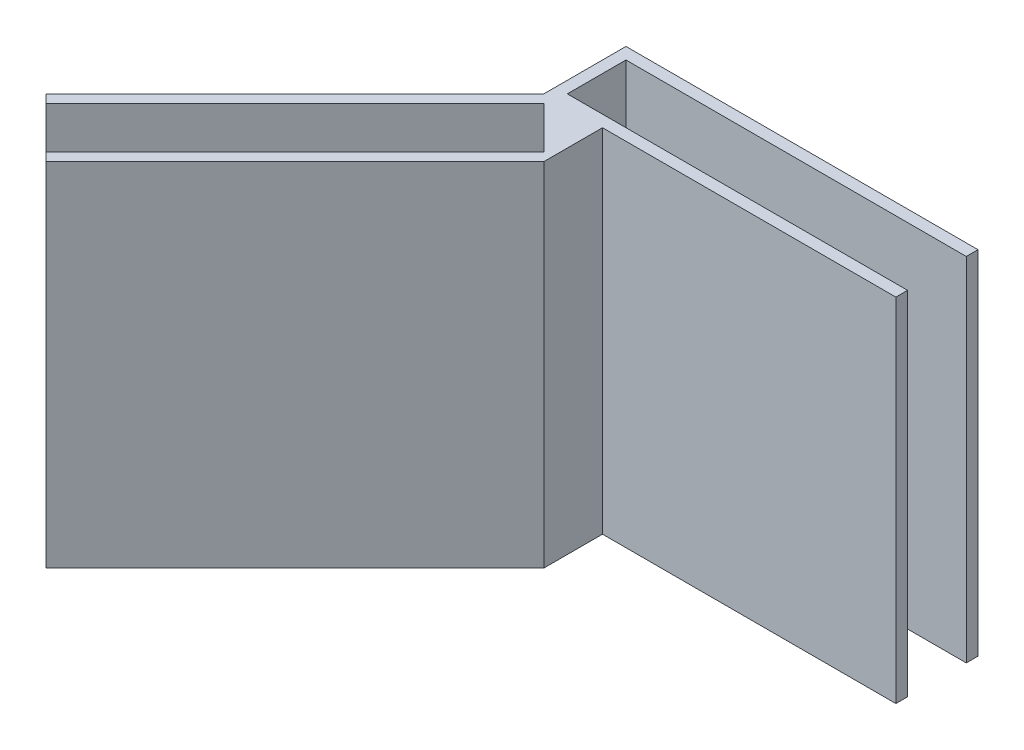
ISO-10303-21;
HEADER;
FILE_DESCRIPTION(('STEP AP214'),'2;1');
FILE_NAME('part.step','',(''),(''),'','','');
FILE_SCHEMA(('AUTOMOTIVE_DESIGN { 1 0 10303 214 1 1 1 1 }'));
ENDSEC;
DATA;
#1=APPLICATION_CONTEXT('core data for automotive mechanical design processes');
#2=APPLICATION_PROTOCOL_DEFINITION('international standard','automotive_design',2000,#1);
#3=PRODUCT_CONTEXT('',#1,'mechanical');
#4=PRODUCT('Part','Part','',(#3));
#5=PRODUCT_RELATED_PRODUCT_CATEGORY('part','',(#4));
#6=PRODUCT_DEFINITION_FORMATION('','',#4);
#7=PRODUCT_DEFINITION_CONTEXT('part definition',#1,'design');
#8=PRODUCT_DEFINITION('design','',#6,#7);
#9=PRODUCT_DEFINITION_SHAPE('','',#8);
#10=(LENGTH_UNIT() NAMED_UNIT(*) SI_UNIT(.MILLI.,.METRE.));
#11=(NAMED_UNIT(*) PLANE_ANGLE_UNIT() SI_UNIT($,.RADIAN.));
#12=(NAMED_UNIT(*) SI_UNIT($,.STERADIAN.) SOLID_ANGLE_UNIT());
#13=UNCERTAINTY_MEASURE_WITH_UNIT(LENGTH_MEASURE(1.E-05),#10,'distance_accuracy_value','');
#14=(GEOMETRIC_REPRESENTATION_CONTEXT(3) GLOBAL_UNCERTAINTY_ASSIGNED_CONTEXT((#13)) GLOBAL_UNIT_ASSIGNED_CONTEXT((#10,
#11,#12)) REPRESENTATION_CONTEXT('',''));
#15=CARTESIAN_POINT('',(0.,0.,0.));
#16=DIRECTION('',(0.,0.,1.));
#17=DIRECTION('',(1.,0.,0.));
#18=AXIS2_PLACEMENT_3D('',#15,#16,#17);
#19=CARTESIAN_POINT('',(-24.7132034355964,0.,24.7132034355964));
#20=DIRECTION('',(-0.707106781186548,0.,0.707106781186547));
#21=DIRECTION('',(0.707106781186547,0.,0.707106781186548));
#22=AXIS2_PLACEMENT_3D('',#19,#20,#21);
#23=PLANE('',#22);
#24=DIRECTION('',(0.,-1.,0.));
#25=VECTOR('',#24,1.);
#26=CARTESIAN_POINT('',(-20.5060966544099,22.,28.920310216783));
#27=LINE('',#26,#25);
#28=CARTESIAN_POINT('',(-20.5060966544099,30.,28.920310216783));
#29=VERTEX_POINT('',#28);
#30=CARTESIAN_POINT('',(-20.5060966544099,0.,28.920310216783));
#31=VERTEX_POINT('',#30);
#32=EDGE_CURVE('E255',#29,#31,#27,.T.);
#33=ORIENTED_EDGE('',*,*,#32,.F.);
#34=DIRECTION('',(0.707106781186547,0.,0.707106781186548));
#35=VECTOR('',#34,1.);
#36=CARTESIAN_POINT('',(-21.2132034355964,30.,28.2132034355964));
#37=LINE('',#36,#35);
#38=CARTESIAN_POINT('',(-21.2132034355964,30.,28.2132034355964));
#39=VERTEX_POINT('',#38);
#40=EDGE_CURVE('E243',#39,#29,#37,.T.);
#41=ORIENTED_EDGE('',*,*,#40,.F.);
#42=DIRECTION('',(0.,-1.,0.));
#43=VECTOR('',#42,1.);
#44=CARTESIAN_POINT('',(-21.2132034355964,23.,28.2132034355964));
#45=LINE('',#44,#43);
#46=CARTESIAN_POINT('',(-21.2132034355964,0.,28.2132034355964));
#47=VERTEX_POINT('',#46);
#48=EDGE_CURVE('E259',#39,#47,#45,.T.);
#49=ORIENTED_EDGE('',*,*,#48,.T.);
#50=DIRECTION('',(0.707106781186547,0.,0.707106781186548));
#51=VECTOR('',#50,1.);
#52=CARTESIAN_POINT('',(-21.2132034355964,0.,28.2132034355964));
#53=LINE('',#52,#51);
#54=EDGE_CURVE('E268',#47,#31,#53,.T.);
#55=ORIENTED_EDGE('',*,*,#54,.T.);
#56=EDGE_LOOP('',(#33,#41,#49,#55));
#57=FACE_BOUND('',#56,.T.);
#58=ADVANCED_FACE('F35',(#57),#23,.T.);
#59=CARTESIAN_POINT('',(30.,0.,7.));
#60=DIRECTION('',(-1.,0.,0.));
#61=DIRECTION('',(0.,0.,1.));
#62=AXIS2_PLACEMENT_3D('',#59,#60,#61);
#63=PLANE('',#62);
#64=DIRECTION('',(0.,1.,0.));
#65=VECTOR('',#64,1.);
#66=CARTESIAN_POINT('',(30.,0.,6.));
#67=LINE('',#66,#65);
#68=CARTESIAN_POINT('',(30.,0.,6.));
#69=VERTEX_POINT('',#68);
#70=CARTESIAN_POINT('',(30.,30.,6.));
#71=VERTEX_POINT('',#70);
#72=EDGE_CURVE('E118',#69,#71,#67,.T.);
#73=ORIENTED_EDGE('',*,*,#72,.T.);
#74=DIRECTION('',(0.,0.,-1.));
#75=VECTOR('',#74,1.);
#76=CARTESIAN_POINT('',(30.,30.,7.));
#77=LINE('',#76,#75);
#78=CARTESIAN_POINT('',(30.,30.,7.));
#79=VERTEX_POINT('',#78);
#80=EDGE_CURVE('E88',#79,#71,#77,.T.);
#81=ORIENTED_EDGE('',*,*,#80,.F.);
#82=DIRECTION('',(0.,1.,0.));
#83=VECTOR('',#82,1.);
#84=CARTESIAN_POINT('',(30.,0.,7.));
#85=LINE('',#84,#83);
#86=CARTESIAN_POINT('',(30.,0.,7.));
#87=VERTEX_POINT('',#86);
#88=EDGE_CURVE('E105',#87,#79,#85,.T.);
#89=ORIENTED_EDGE('',*,*,#88,.F.);
#90=DIRECTION('',(0.,0.,-1.));
#91=VECTOR('',#90,1.);
#92=CARTESIAN_POINT('',(30.,0.,7.));
#93=LINE('',#92,#91);
#94=EDGE_CURVE('E43',#87,#69,#93,.T.);
#95=ORIENTED_EDGE('',*,*,#94,.T.);
#96=EDGE_LOOP('',(#73,#81,#89,#95));
#97=FACE_BOUND('',#96,.T.);
#98=ADVANCED_FACE('F114',(#97),#63,.F.);
#99=CARTESIAN_POINT('',(0.,0.,7.));
#100=DIRECTION('',(0.,0.,-1.));
#101=DIRECTION('',(-1.,0.,0.));
#102=AXIS2_PLACEMENT_3D('',#99,#100,#101);
#103=PLANE('',#102);
#104=DIRECTION('',(-1.,0.,0.));
#105=VECTOR('',#104,1.);
#106=CARTESIAN_POINT('',(0.,30.,7.));
#107=LINE('',#106,#105);
#108=CARTESIAN_POINT('',(5.,30.,7.));
#109=VERTEX_POINT('',#108);
#110=EDGE_CURVE('E245',#79,#109,#107,.T.);
#111=ORIENTED_EDGE('',*,*,#110,.T.);
#112=DIRECTION('',(0.,1.,0.));
#113=VECTOR('',#112,1.);
#114=CARTESIAN_POINT('',(5.,0.,7.));
#115=LINE('',#114,#113);
#116=CARTESIAN_POINT('',(5.,0.,7.));
#117=VERTEX_POINT('',#116);
#118=EDGE_CURVE('E50',#117,#109,#115,.T.);
#119=ORIENTED_EDGE('',*,*,#118,.F.);
#120=DIRECTION('',(1.,0.,0.));
#121=VECTOR('',#120,1.);
#122=CARTESIAN_POINT('',(0.,0.,7.));
#123=LINE('',#122,#121);
#124=EDGE_CURVE('E55',#117,#87,#123,.T.);
#125=ORIENTED_EDGE('',*,*,#124,.T.);
#126=ORIENTED_EDGE('',*,*,#88,.T.);
#127=EDGE_LOOP('',(#111,#119,#125,#126));
#128=FACE_BOUND('',#127,.T.);
#129=ADVANCED_FACE('F332',(#128),#103,.F.);
#130=CARTESIAN_POINT('',(-21.2132034355964,23.,28.2132034355964));
#131=DIRECTION('',(0.707106781186547,0.,0.707106781186548));
#132=DIRECTION('',(0.707106781186548,0.,-0.707106781186547));
#133=AXIS2_PLACEMENT_3D('',#130,#131,#132);
#134=PLANE('',#133);
#135=ORIENTED_EDGE('',*,*,#48,.F.);
#136=DIRECTION('',(-0.707106781186547,0.,0.707106781186547));
#137=VECTOR('',#136,1.);
#138=CARTESIAN_POINT('',(0.,30.,7.));
#139=LINE('',#138,#137);
#140=CARTESIAN_POINT('',(0.,30.,7.));
#141=VERTEX_POINT('',#140);
#142=EDGE_CURVE('E155',#141,#39,#139,.T.);
#143=ORIENTED_EDGE('',*,*,#142,.F.);
#144=DIRECTION('',(0.,-1.,0.));
#145=VECTOR('',#144,1.);
#146=CARTESIAN_POINT('',(0.,23.,7.));
#147=LINE('',#146,#145);
#148=CARTESIAN_POINT('',(0.,0.,7.));
#149=VERTEX_POINT('',#148);
#150=EDGE_CURVE('E151',#141,#149,#147,.T.);
#151=ORIENTED_EDGE('',*,*,#150,.T.);
#152=DIRECTION('',(0.707106781186548,0.,-0.707106781186547));
#153=VECTOR('',#152,1.);
#154=CARTESIAN_POINT('',(-21.2132034355964,0.,28.2132034355964));
#155=LINE('',#154,#153);
#156=EDGE_CURVE('E274',#47,#149,#155,.T.);
#157=ORIENTED_EDGE('',*,*,#156,.F.);
#158=EDGE_LOOP('',(#135,#143,#151,#157));
#159=FACE_BOUND('',#158,.T.);
#160=ADVANCED_FACE('F335',(#159),#134,.F.);
#161=CARTESIAN_POINT('',(0.,0.,7.));
#162=DIRECTION('',(1.,0.,0.));
#163=DIRECTION('',(0.,0.,-1.));
#164=AXIS2_PLACEMENT_3D('',#161,#162,#163);
#165=PLANE('',#164);
#166=DIRECTION('',(0.,0.,-1.));
#167=VECTOR('',#166,1.);
#168=CARTESIAN_POINT('',(0.,0.,7.));
#169=LINE('',#168,#167);
#170=CARTESIAN_POINT('',(0.,0.,0.));
#171=VERTEX_POINT('',#170);
#172=EDGE_CURVE('E11',#149,#171,#169,.T.);
#173=ORIENTED_EDGE('',*,*,#172,.F.);
#174=ORIENTED_EDGE('',*,*,#150,.F.);
#175=DIRECTION('',(0.,0.,-1.));
#176=VECTOR('',#175,1.);
#177=CARTESIAN_POINT('',(0.,30.,7.));
#178=LINE('',#177,#176);
#179=CARTESIAN_POINT('',(0.,30.,0.));
#180=VERTEX_POINT('',#179);
#181=EDGE_CURVE('E89',#141,#180,#178,.T.);
#182=ORIENTED_EDGE('',*,*,#181,.T.);
#183=DIRECTION('',(0.,-1.,0.));
#184=VECTOR('',#183,1.);
#185=CARTESIAN_POINT('',(0.,0.,0.));
#186=LINE('',#185,#184);
#187=EDGE_CURVE('E103',#180,#171,#186,.T.);
#188=ORIENTED_EDGE('',*,*,#187,.T.);
#189=EDGE_LOOP('',(#173,#174,#182,#188));
#190=FACE_BOUND('',#189,.T.);
#191=ADVANCED_FACE('F37',(#190),#165,.F.);
#192=CARTESIAN_POINT('',(0.,0.,7.));
#193=DIRECTION('',(0.,1.,0.));
#194=DIRECTION('',(0.,0.,1.));
#195=AXIS2_PLACEMENT_3D('',#192,#193,#194);
#196=PLANE('',#195);
#197=CARTESIAN_POINT('',(-16.920310216783,0.,32.5060966544099));
#198=VERTEX_POINT('',#197);
#199=CARTESIAN_POINT('',(-16.2132034355964,0.,33.2132034355964));
#200=VERTEX_POINT('',#199);
#201=EDGE_CURVE('E267',#198,#200,#53,.T.);
#202=ORIENTED_EDGE('',*,*,#201,.F.);
#203=DIRECTION('',(-0.707106781186546,0.,0.707106781186549));
#204=VECTOR('',#203,1.);
#205=CARTESIAN_POINT('',(-16.2132034355964,0.,31.7989898732233));
#206=LINE('',#205,#204);
#207=CARTESIAN_POINT('',(4.29289321881345,0.,11.2928932188134));
#208=VERTEX_POINT('',#207);
#209=EDGE_CURVE('E253',#208,#198,#206,.T.);
#210=ORIENTED_EDGE('',*,*,#209,.F.);
#211=DIRECTION('',(0.707106781186547,0.,0.707106781186547));
#212=VECTOR('',#211,1.);
#213=CARTESIAN_POINT('',(4.29289321881345,0.,11.2928932188134));
#214=LINE('',#213,#212);
#215=CARTESIAN_POINT('',(0.707106781186545,0.,7.70710678118655));
#216=VERTEX_POINT('',#215);
#217=EDGE_CURVE('E250',#216,#208,#214,.T.);
#218=ORIENTED_EDGE('',*,*,#217,.F.);
#219=DIRECTION('',(0.707106781186548,0.,-0.707106781186548));
#220=VECTOR('',#219,1.);
#221=CARTESIAN_POINT('',(-19.7989898732233,0.,28.2132034355964));
#222=LINE('',#221,#220);
#223=EDGE_CURVE('E247',#31,#216,#222,.T.);
#224=ORIENTED_EDGE('',*,*,#223,.F.);
#225=ORIENTED_EDGE('',*,*,#54,.F.);
#226=ORIENTED_EDGE('',*,*,#156,.T.);
#227=ORIENTED_EDGE('',*,*,#172,.T.);
#228=DIRECTION('',(1.,0.,0.));
#229=VECTOR('',#228,1.);
#230=CARTESIAN_POINT('',(0.,0.,0.));
#231=LINE('',#230,#229);
#232=CARTESIAN_POINT('',(30.,0.,0.));
#233=VERTEX_POINT('',#232);
#234=EDGE_CURVE('E99',#171,#233,#231,.T.);
#235=ORIENTED_EDGE('',*,*,#234,.T.);
#236=CARTESIAN_POINT('',(30.,0.,1.));
#237=VERTEX_POINT('',#236);
#238=EDGE_CURVE('E95',#237,#233,#93,.T.);
#239=ORIENTED_EDGE('',*,*,#238,.F.);
#240=DIRECTION('',(1.,0.,0.));
#241=VECTOR('',#240,1.);
#242=CARTESIAN_POINT('',(0.,0.,1.));
#243=LINE('',#242,#241);
#244=CARTESIAN_POINT('',(1.,0.,1.));
#245=VERTEX_POINT('',#244);
#246=EDGE_CURVE('E198',#245,#237,#243,.T.);
#247=ORIENTED_EDGE('',*,*,#246,.F.);
#248=DIRECTION('',(0.,0.,-1.));
#249=VECTOR('',#248,1.);
#250=CARTESIAN_POINT('',(1.,0.,7.));
#251=LINE('',#250,#249);
#252=CARTESIAN_POINT('',(1.,0.,6.));
#253=VERTEX_POINT('',#252);
#254=EDGE_CURVE('E131',#253,#245,#251,.T.);
#255=ORIENTED_EDGE('',*,*,#254,.F.);
#256=DIRECTION('',(1.,0.,0.));
#257=VECTOR('',#256,1.);
#258=CARTESIAN_POINT('',(0.,0.,6.));
#259=LINE('',#258,#257);
#260=EDGE_CURVE('E128',#253,#69,#259,.T.);
#261=ORIENTED_EDGE('',*,*,#260,.T.);
#262=ORIENTED_EDGE('',*,*,#94,.F.);
#263=ORIENTED_EDGE('',*,*,#124,.F.);
#264=DIRECTION('',(0.,0.,-1.));
#265=VECTOR('',#264,1.);
#266=CARTESIAN_POINT('',(5.,0.,12.));
#267=LINE('',#266,#265);
#268=CARTESIAN_POINT('',(5.,0.,12.));
#269=VERTEX_POINT('',#268);
#270=EDGE_CURVE('E227',#269,#117,#267,.T.);
#271=ORIENTED_EDGE('',*,*,#270,.F.);
#272=DIRECTION('',(0.707106781186548,0.,-0.707106781186547));
#273=VECTOR('',#272,1.);
#274=CARTESIAN_POINT('',(-16.2132034355964,0.,33.2132034355964));
#275=LINE('',#274,#273);
#276=EDGE_CURVE('E225',#200,#269,#275,.T.);
#277=ORIENTED_EDGE('',*,*,#276,.F.);
#278=EDGE_LOOP('',(#202,#210,#218,#224,#225,#226,#227,#235,#239,#247,#255,#261,#262,#263,#271,#277));
#279=FACE_BOUND('',#278,.T.);
#280=ADVANCED_FACE('F123',(#279),#196,.F.);
#281=CARTESIAN_POINT('',(30.,30.,1.));
#282=VERTEX_POINT('',#281);
#283=CARTESIAN_POINT('',(30.,30.,0.));
#284=VERTEX_POINT('',#283);
#285=EDGE_CURVE('E74',#282,#284,#77,.T.);
#286=ORIENTED_EDGE('',*,*,#285,.F.);
#287=DIRECTION('',(0.,1.,0.));
#288=VECTOR('',#287,1.);
#289=CARTESIAN_POINT('',(30.,0.,1.));
#290=LINE('',#289,#288);
#291=EDGE_CURVE('E138',#237,#282,#290,.T.);
#292=ORIENTED_EDGE('',*,*,#291,.F.);
#293=ORIENTED_EDGE('',*,*,#238,.T.);
#294=DIRECTION('',(0.,1.,0.));
#295=VECTOR('',#294,1.);
#296=CARTESIAN_POINT('',(30.,0.,0.));
#297=LINE('',#296,#295);
#298=EDGE_CURVE('E92',#233,#284,#297,.T.);
#299=ORIENTED_EDGE('',*,*,#298,.T.);
#300=EDGE_LOOP('',(#286,#292,#293,#299));
#301=FACE_BOUND('',#300,.T.);
#302=ADVANCED_FACE('F93',(#301),#63,.F.);
#303=CARTESIAN_POINT('',(0.,30.,7.));
#304=DIRECTION('',(0.,-1.,0.));
#305=DIRECTION('',(0.,0.,-1.));
#306=AXIS2_PLACEMENT_3D('',#303,#304,#305);
#307=PLANE('',#306);
#308=ORIENTED_EDGE('',*,*,#40,.T.);
#309=DIRECTION('',(0.707106781186548,0.,-0.707106781186548));
#310=VECTOR('',#309,1.);
#311=CARTESIAN_POINT('',(0.707106781186544,30.,7.70710678118654));
#312=LINE('',#311,#310);
#313=CARTESIAN_POINT('',(0.707106781186545,30.,7.70710678118655));
#314=VERTEX_POINT('',#313);
#315=EDGE_CURVE('E307',#29,#314,#312,.T.);
#316=ORIENTED_EDGE('',*,*,#315,.T.);
#317=DIRECTION('',(0.707106781186548,0.,0.707106781186548));
#318=VECTOR('',#317,1.);
#319=CARTESIAN_POINT('',(0.,30.,7.));
#320=LINE('',#319,#318);
#321=CARTESIAN_POINT('',(4.29289321881345,30.,11.2928932188134));
#322=VERTEX_POINT('',#321);
#323=EDGE_CURVE('E300',#314,#322,#320,.T.);
#324=ORIENTED_EDGE('',*,*,#323,.T.);
#325=DIRECTION('',(-0.707106781186547,0.,0.707106781186548));
#326=VECTOR('',#325,1.);
#327=CARTESIAN_POINT('',(4.29289321881345,30.,11.2928932188134));
#328=LINE('',#327,#326);
#329=CARTESIAN_POINT('',(-16.920310216783,30.,32.5060966544099));
#330=VERTEX_POINT('',#329);
#331=EDGE_CURVE('E305',#322,#330,#328,.T.);
#332=ORIENTED_EDGE('',*,*,#331,.T.);
#333=CARTESIAN_POINT('',(-16.2132034355964,30.,33.2132034355964));
#334=VERTEX_POINT('',#333);
#335=EDGE_CURVE('E236',#330,#334,#37,.T.);
#336=ORIENTED_EDGE('',*,*,#335,.T.);
#337=DIRECTION('',(0.707106781186548,0.,-0.707106781186547));
#338=VECTOR('',#337,1.);
#339=CARTESIAN_POINT('',(-16.2132034355964,30.,33.2132034355964));
#340=LINE('',#339,#338);
#341=CARTESIAN_POINT('',(4.99999999999999,30.,12.));
#342=VERTEX_POINT('',#341);
#343=EDGE_CURVE('E223',#334,#342,#340,.T.);
#344=ORIENTED_EDGE('',*,*,#343,.T.);
#345=DIRECTION('',(0.,0.,-1.));
#346=VECTOR('',#345,1.);
#347=CARTESIAN_POINT('',(4.99999999999999,30.,12.));
#348=LINE('',#347,#346);
#349=EDGE_CURVE('E230',#342,#109,#348,.T.);
#350=ORIENTED_EDGE('',*,*,#349,.T.);
#351=ORIENTED_EDGE('',*,*,#110,.F.);
#352=ORIENTED_EDGE('',*,*,#80,.T.);
#353=DIRECTION('',(1.,0.,0.));
#354=VECTOR('',#353,1.);
#355=CARTESIAN_POINT('',(30.,30.,6.));
#356=LINE('',#355,#354);
#357=CARTESIAN_POINT('',(1.,30.,6.));
#358=VERTEX_POINT('',#357);
#359=EDGE_CURVE('E207',#358,#71,#356,.T.);
#360=ORIENTED_EDGE('',*,*,#359,.F.);
#361=DIRECTION('',(0.,0.,1.));
#362=VECTOR('',#361,1.);
#363=CARTESIAN_POINT('',(1.,30.,6.));
#364=LINE('',#363,#362);
#365=CARTESIAN_POINT('',(1.,30.,1.));
#366=VERTEX_POINT('',#365);
#367=EDGE_CURVE('E204',#366,#358,#364,.T.);
#368=ORIENTED_EDGE('',*,*,#367,.F.);
#369=DIRECTION('',(-1.,0.,0.));
#370=VECTOR('',#369,1.);
#371=CARTESIAN_POINT('',(1.,30.,1.));
#372=LINE('',#371,#370);
#373=EDGE_CURVE('E85',#282,#366,#372,.T.);
#374=ORIENTED_EDGE('',*,*,#373,.F.);
#375=ORIENTED_EDGE('',*,*,#285,.T.);
#376=DIRECTION('',(-1.,0.,0.));
#377=VECTOR('',#376,1.);
#378=CARTESIAN_POINT('',(0.,30.,0.));
#379=LINE('',#378,#377);
#380=EDGE_CURVE('E80',#284,#180,#379,.T.);
#381=ORIENTED_EDGE('',*,*,#380,.T.);
#382=ORIENTED_EDGE('',*,*,#181,.F.);
#383=ORIENTED_EDGE('',*,*,#142,.T.);
#384=EDGE_LOOP('',(#308,#316,#324,#332,#336,#344,#350,#351,#352,#360,#368,#374,#375,#381,#382,#383));
#385=FACE_BOUND('',#384,.T.);
#386=ADVANCED_FACE('F77',(#385),#307,.F.);
#387=CARTESIAN_POINT('',(0.,0.,0.));
#388=DIRECTION('',(0.,0.,-1.));
#389=DIRECTION('',(-1.,0.,0.));
#390=AXIS2_PLACEMENT_3D('',#387,#388,#389);
#391=PLANE('',#390);
#392=ORIENTED_EDGE('',*,*,#187,.F.);
#393=ORIENTED_EDGE('',*,*,#380,.F.);
#394=ORIENTED_EDGE('',*,*,#298,.F.);
#395=ORIENTED_EDGE('',*,*,#234,.F.);
#396=EDGE_LOOP('',(#392,#393,#394,#395));
#397=FACE_BOUND('',#396,.T.);
#398=ADVANCED_FACE('F101',(#397),#391,.T.);
#399=CARTESIAN_POINT('',(1.,0.,7.));
#400=DIRECTION('',(1.,0.,0.));
#401=DIRECTION('',(0.,0.,-1.));
#402=AXIS2_PLACEMENT_3D('',#399,#400,#401);
#403=PLANE('',#402);
#404=ORIENTED_EDGE('',*,*,#254,.T.);
#405=DIRECTION('',(0.,-1.,0.));
#406=VECTOR('',#405,1.);
#407=CARTESIAN_POINT('',(1.,0.,1.));
#408=LINE('',#407,#406);
#409=EDGE_CURVE('E279',#366,#245,#408,.T.);
#410=ORIENTED_EDGE('',*,*,#409,.F.);
#411=ORIENTED_EDGE('',*,*,#367,.T.);
#412=DIRECTION('',(0.,-1.,0.));
#413=VECTOR('',#412,1.);
#414=CARTESIAN_POINT('',(1.,0.,6.));
#415=LINE('',#414,#413);
#416=EDGE_CURVE('E134',#358,#253,#415,.T.);
#417=ORIENTED_EDGE('',*,*,#416,.T.);
#418=EDGE_LOOP('',(#404,#410,#411,#417));
#419=FACE_BOUND('',#418,.T.);
#420=ADVANCED_FACE('F201',(#419),#403,.T.);
#421=CARTESIAN_POINT('',(0.,0.,6.));
#422=DIRECTION('',(0.,0.,-1.));
#423=DIRECTION('',(-1.,0.,0.));
#424=AXIS2_PLACEMENT_3D('',#421,#422,#423);
#425=PLANE('',#424);
#426=ORIENTED_EDGE('',*,*,#260,.F.);
#427=ORIENTED_EDGE('',*,*,#416,.F.);
#428=ORIENTED_EDGE('',*,*,#359,.T.);
#429=ORIENTED_EDGE('',*,*,#72,.F.);
#430=EDGE_LOOP('',(#426,#427,#428,#429));
#431=FACE_BOUND('',#430,.T.);
#432=ADVANCED_FACE('F206',(#431),#425,.T.);
#433=CARTESIAN_POINT('',(0.,0.,1.));
#434=DIRECTION('',(0.,0.,-1.));
#435=DIRECTION('',(-1.,0.,0.));
#436=AXIS2_PLACEMENT_3D('',#433,#434,#435);
#437=PLANE('',#436);
#438=ORIENTED_EDGE('',*,*,#291,.T.);
#439=ORIENTED_EDGE('',*,*,#373,.T.);
#440=ORIENTED_EDGE('',*,*,#409,.T.);
#441=ORIENTED_EDGE('',*,*,#246,.T.);
#442=EDGE_LOOP('',(#438,#439,#440,#441));
#443=FACE_BOUND('',#442,.T.);
#444=ADVANCED_FACE('F282',(#443),#437,.F.);
#445=CARTESIAN_POINT('',(5.,0.,12.));
#446=DIRECTION('',(-1.,0.,0.));
#447=DIRECTION('',(0.,0.,1.));
#448=AXIS2_PLACEMENT_3D('',#445,#446,#447);
#449=PLANE('',#448);
#450=ORIENTED_EDGE('',*,*,#118,.T.);
#451=ORIENTED_EDGE('',*,*,#349,.F.);
#452=DIRECTION('',(0.,1.,0.));
#453=VECTOR('',#452,1.);
#454=CARTESIAN_POINT('',(5.,0.,12.));
#455=LINE('',#454,#453);
#456=EDGE_CURVE('E218',#269,#342,#455,.T.);
#457=ORIENTED_EDGE('',*,*,#456,.F.);
#458=ORIENTED_EDGE('',*,*,#270,.T.);
#459=EDGE_LOOP('',(#450,#451,#457,#458));
#460=FACE_BOUND('',#459,.T.);
#461=ADVANCED_FACE('F231',(#460),#449,.F.);
#462=CARTESIAN_POINT('',(-16.2132034355964,0.,33.2132034355964));
#463=DIRECTION('',(-0.707106781186547,0.,-0.707106781186548));
#464=DIRECTION('',(-0.707106781186548,0.,0.707106781186547));
#465=AXIS2_PLACEMENT_3D('',#462,#463,#464);
#466=PLANE('',#465);
#467=ORIENTED_EDGE('',*,*,#456,.T.);
#468=ORIENTED_EDGE('',*,*,#343,.F.);
#469=DIRECTION('',(0.,1.,0.));
#470=VECTOR('',#469,1.);
#471=CARTESIAN_POINT('',(-16.2132034355964,0.,33.2132034355964));
#472=LINE('',#471,#470);
#473=EDGE_CURVE('E271',#200,#334,#472,.T.);
#474=ORIENTED_EDGE('',*,*,#473,.F.);
#475=ORIENTED_EDGE('',*,*,#276,.T.);
#476=EDGE_LOOP('',(#467,#468,#474,#475));
#477=FACE_BOUND('',#476,.T.);
#478=ADVANCED_FACE('F220',(#477),#466,.F.);
#479=ORIENTED_EDGE('',*,*,#335,.F.);
#480=DIRECTION('',(0.,-1.,0.));
#481=VECTOR('',#480,1.);
#482=CARTESIAN_POINT('',(-16.920310216783,22.,32.5060966544099));
#483=LINE('',#482,#481);
#484=EDGE_CURVE('E256',#330,#198,#483,.T.);
#485=ORIENTED_EDGE('',*,*,#484,.T.);
#486=ORIENTED_EDGE('',*,*,#201,.T.);
#487=ORIENTED_EDGE('',*,*,#473,.T.);
#488=EDGE_LOOP('',(#479,#485,#486,#487));
#489=FACE_BOUND('',#488,.T.);
#490=ADVANCED_FACE('F317',(#489),#23,.T.);
#491=CARTESIAN_POINT('',(-16.2132034355964,22.,31.7989898732233));
#492=DIRECTION('',(0.707106781186549,0.,0.707106781186546));
#493=DIRECTION('',(0.707106781186546,0.,-0.707106781186549));
#494=AXIS2_PLACEMENT_3D('',#491,#492,#493);
#495=PLANE('',#494);
#496=ORIENTED_EDGE('',*,*,#209,.T.);
#497=ORIENTED_EDGE('',*,*,#484,.F.);
#498=ORIENTED_EDGE('',*,*,#331,.F.);
#499=DIRECTION('',(0.,-1.,0.));
#500=VECTOR('',#499,1.);
#501=CARTESIAN_POINT('',(4.29289321881345,22.,11.2928932188134));
#502=LINE('',#501,#500);
#503=EDGE_CURVE('E260',#322,#208,#502,.T.);
#504=ORIENTED_EDGE('',*,*,#503,.T.);
#505=EDGE_LOOP('',(#496,#497,#498,#504));
#506=FACE_BOUND('',#505,.T.);
#507=ADVANCED_FACE('F306',(#506),#495,.F.);
#508=CARTESIAN_POINT('',(4.29289321881345,22.,11.2928932188134));
#509=DIRECTION('',(0.707106781186548,0.,-0.707106781186548));
#510=DIRECTION('',(-0.707106781186548,0.,-0.707106781186548));
#511=AXIS2_PLACEMENT_3D('',#508,#509,#510);
#512=PLANE('',#511);
#513=ORIENTED_EDGE('',*,*,#217,.T.);
#514=ORIENTED_EDGE('',*,*,#503,.F.);
#515=ORIENTED_EDGE('',*,*,#323,.F.);
#516=DIRECTION('',(0.,-1.,0.));
#517=VECTOR('',#516,1.);
#518=CARTESIAN_POINT('',(0.707106781186545,22.,7.70710678118655));
#519=LINE('',#518,#517);
#520=EDGE_CURVE('E262',#314,#216,#519,.T.);
#521=ORIENTED_EDGE('',*,*,#520,.T.);
#522=EDGE_LOOP('',(#513,#514,#515,#521));
#523=FACE_BOUND('',#522,.T.);
#524=ADVANCED_FACE('F298',(#523),#512,.F.);
#525=CARTESIAN_POINT('',(-19.7989898732233,22.,28.2132034355964));
#526=DIRECTION('',(-0.707106781186548,0.,-0.707106781186548));
#527=DIRECTION('',(-0.707106781186548,0.,0.707106781186548));
#528=AXIS2_PLACEMENT_3D('',#525,#526,#527);
#529=PLANE('',#528);
#530=ORIENTED_EDGE('',*,*,#223,.T.);
#531=ORIENTED_EDGE('',*,*,#520,.F.);
#532=ORIENTED_EDGE('',*,*,#315,.F.);
#533=ORIENTED_EDGE('',*,*,#32,.T.);
#534=EDGE_LOOP('',(#530,#531,#532,#533));
#535=FACE_BOUND('',#534,.T.);
#536=ADVANCED_FACE('F314',(#535),#529,.F.);
#537=CLOSED_SHELL('',(#58,#98,#129,#160,#191,#280,#302,#386,#398,#420,#432,#444,#461,#478,#490,
#507,#524,#536));
#538=MANIFOLD_SOLID_BREP('B2',#537);
#539=ADVANCED_BREP_SHAPE_REPRESENTATION('',(#18,#538),#14);
#540=SHAPE_DEFINITION_REPRESENTATION(#9,#539);
ENDSEC;
END-ISO-10303-21;
